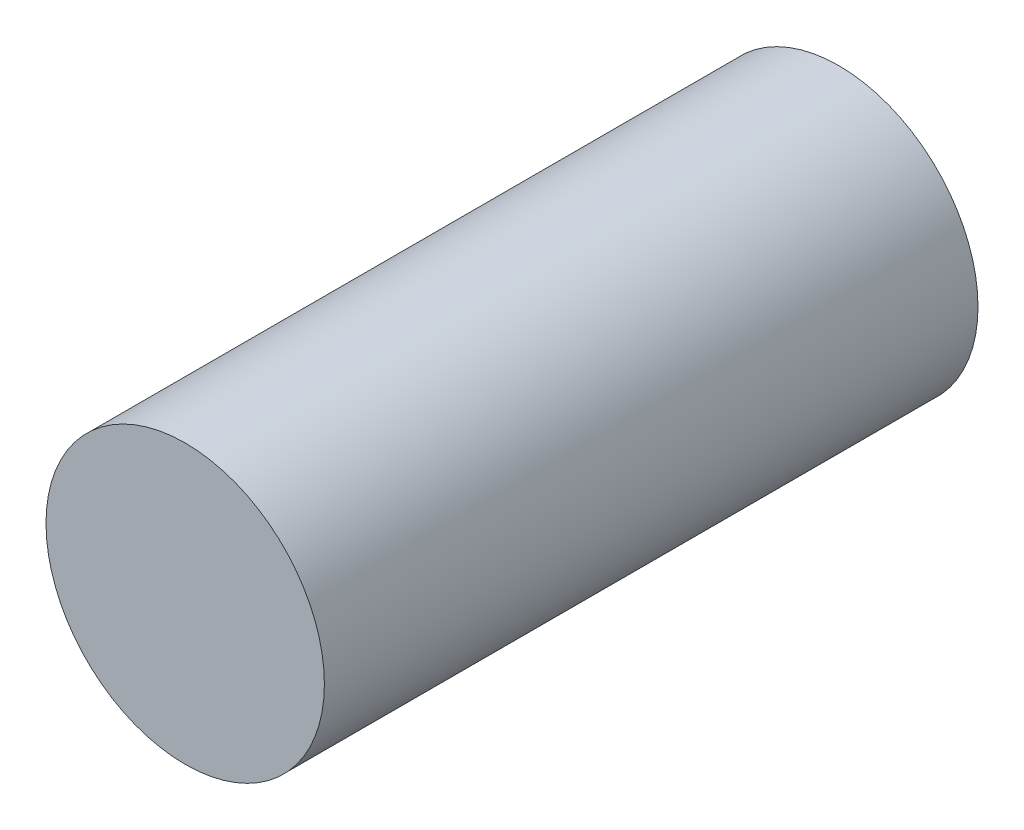
ISO-10303-21;
HEADER;
FILE_DESCRIPTION(('STEP AP214'),'2;1');
FILE_NAME('part.step','',(''),(''),'','','');
FILE_SCHEMA(('AUTOMOTIVE_DESIGN { 1 0 10303 214 1 1 1 1 }'));
ENDSEC;
DATA;
#1=APPLICATION_CONTEXT('core data for automotive mechanical design processes');
#2=APPLICATION_PROTOCOL_DEFINITION('international standard','automotive_design',2000,#1);
#3=PRODUCT_CONTEXT('',#1,'mechanical');
#4=PRODUCT('Part','Part','',(#3));
#5=PRODUCT_RELATED_PRODUCT_CATEGORY('part','',(#4));
#6=PRODUCT_DEFINITION_FORMATION('','',#4);
#7=PRODUCT_DEFINITION_CONTEXT('part definition',#1,'design');
#8=PRODUCT_DEFINITION('design','',#6,#7);
#9=PRODUCT_DEFINITION_SHAPE('','',#8);
#10=(LENGTH_UNIT() NAMED_UNIT(*) SI_UNIT(.MILLI.,.METRE.));
#11=(NAMED_UNIT(*) PLANE_ANGLE_UNIT() SI_UNIT($,.RADIAN.));
#12=(NAMED_UNIT(*) SI_UNIT($,.STERADIAN.) SOLID_ANGLE_UNIT());
#13=UNCERTAINTY_MEASURE_WITH_UNIT(LENGTH_MEASURE(1.E-05),#10,'distance_accuracy_value','');
#14=(GEOMETRIC_REPRESENTATION_CONTEXT(3) GLOBAL_UNCERTAINTY_ASSIGNED_CONTEXT((#13)) GLOBAL_UNIT_ASSIGNED_CONTEXT((#10,
#11,#12)) REPRESENTATION_CONTEXT('',''));
#15=CARTESIAN_POINT('',(0.,0.,0.));
#16=DIRECTION('',(0.,0.,1.));
#17=DIRECTION('',(1.,0.,0.));
#18=AXIS2_PLACEMENT_3D('',#15,#16,#17);
#19=CARTESIAN_POINT('',(0.,0.,13.5));
#20=DIRECTION('',(0.,0.,-1.));
#21=DIRECTION('',(-1.,0.,0.));
#22=AXIS2_PLACEMENT_3D('',#19,#20,#21);
#23=CYLINDRICAL_SURFACE('',#22,5.75);
#24=CARTESIAN_POINT('',(0.,0.,13.5));
#25=DIRECTION('',(0.,0.,1.));
#26=DIRECTION('',(1.,0.,0.));
#27=AXIS2_PLACEMENT_3D('',#24,#25,#26);
#28=CIRCLE('',#27,5.75);
#29=CARTESIAN_POINT('',(5.75,0.,13.5));
#30=VERTEX_POINT('',#29);
#31=EDGE_CURVE('E10',#30,#30,#28,.T.);
#32=ORIENTED_EDGE('',*,*,#31,.F.);
#33=EDGE_LOOP('',(#32));
#34=FACE_BOUND('',#33,.T.);
#35=CARTESIAN_POINT('',(0.,0.,-13.5));
#36=DIRECTION('',(0.,0.,1.));
#37=DIRECTION('',(1.,0.,0.));
#38=AXIS2_PLACEMENT_3D('',#35,#36,#37);
#39=CIRCLE('',#38,5.75);
#40=CARTESIAN_POINT('',(5.75,0.,-13.5));
#41=VERTEX_POINT('',#40);
#42=EDGE_CURVE('E34',#41,#41,#39,.T.);
#43=ORIENTED_EDGE('',*,*,#42,.T.);
#44=EDGE_LOOP('',(#43));
#45=FACE_BOUND('',#44,.T.);
#46=ADVANCED_FACE('F31',(#34,#45),#23,.T.);
#47=CARTESIAN_POINT('',(0.,0.,13.5));
#48=DIRECTION('',(0.,0.,1.));
#49=DIRECTION('',(1.,0.,0.));
#50=AXIS2_PLACEMENT_3D('',#47,#48,#49);
#51=PLANE('',#50);
#52=ORIENTED_EDGE('',*,*,#31,.T.);
#53=EDGE_LOOP('',(#52));
#54=FACE_BOUND('',#53,.T.);
#55=ADVANCED_FACE('F46',(#54),#51,.T.);
#56=CARTESIAN_POINT('',(0.,0.,-13.5));
#57=DIRECTION('',(0.,0.,1.));
#58=DIRECTION('',(1.,0.,0.));
#59=AXIS2_PLACEMENT_3D('',#56,#57,#58);
#60=PLANE('',#59);
#61=ORIENTED_EDGE('',*,*,#42,.F.);
#62=EDGE_LOOP('',(#61));
#63=FACE_BOUND('',#62,.T.);
#64=ADVANCED_FACE('F44',(#63),#60,.F.);
#65=CLOSED_SHELL('',(#46,#55,#64));
#66=MANIFOLD_SOLID_BREP('B2',#65);
#67=ADVANCED_BREP_SHAPE_REPRESENTATION('',(#18,#66),#14);
#68=SHAPE_DEFINITION_REPRESENTATION(#9,#67);
ENDSEC;
END-ISO-10303-21;
